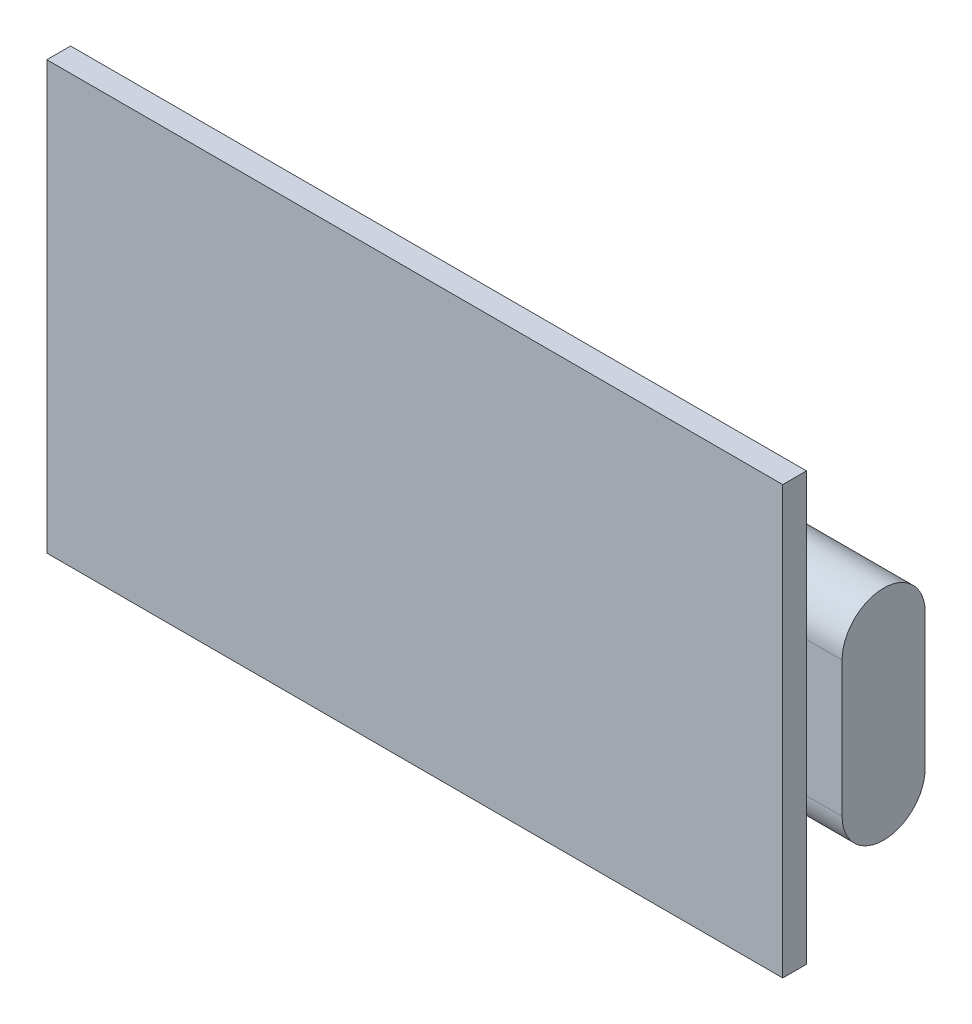
ISO-10303-21;
HEADER;
FILE_DESCRIPTION(('STEP AP214'),'2;1');
FILE_NAME('part.step','',(''),(''),'','','');
FILE_SCHEMA(('AUTOMOTIVE_DESIGN { 1 0 10303 214 1 1 1 1 }'));
ENDSEC;
DATA;
#1=APPLICATION_CONTEXT('core data for automotive mechanical design processes');
#2=APPLICATION_PROTOCOL_DEFINITION('international standard','automotive_design',2000,#1);
#3=PRODUCT_CONTEXT('',#1,'mechanical');
#4=PRODUCT('Part','Part','',(#3));
#5=PRODUCT_RELATED_PRODUCT_CATEGORY('part','',(#4));
#6=PRODUCT_DEFINITION_FORMATION('','',#4);
#7=PRODUCT_DEFINITION_CONTEXT('part definition',#1,'design');
#8=PRODUCT_DEFINITION('design','',#6,#7);
#9=PRODUCT_DEFINITION_SHAPE('','',#8);
#10=(LENGTH_UNIT() NAMED_UNIT(*) SI_UNIT(.MILLI.,.METRE.));
#11=(NAMED_UNIT(*) PLANE_ANGLE_UNIT() SI_UNIT($,.RADIAN.));
#12=(NAMED_UNIT(*) SI_UNIT($,.STERADIAN.) SOLID_ANGLE_UNIT());
#13=UNCERTAINTY_MEASURE_WITH_UNIT(LENGTH_MEASURE(1.E-05),#10,'distance_accuracy_value','');
#14=(GEOMETRIC_REPRESENTATION_CONTEXT(3) GLOBAL_UNCERTAINTY_ASSIGNED_CONTEXT((#13)) GLOBAL_UNIT_ASSIGNED_CONTEXT((#10,
#11,#12)) REPRESENTATION_CONTEXT('',''));
#15=CARTESIAN_POINT('',(0.,0.,0.));
#16=DIRECTION('',(0.,0.,1.));
#17=DIRECTION('',(1.,0.,0.));
#18=AXIS2_PLACEMENT_3D('',#15,#16,#17);
#19=CARTESIAN_POINT('',(0.,0.,0.));
#20=DIRECTION('',(0.,0.,1.));
#21=DIRECTION('',(1.,0.,0.));
#22=AXIS2_PLACEMENT_3D('',#19,#20,#21);
#23=PLANE('',#22);
#24=DIRECTION('',(1.,0.,0.));
#25=VECTOR('',#24,1.);
#26=CARTESIAN_POINT('',(9.50000000000001,2.85,0.));
#27=LINE('',#26,#25);
#28=CARTESIAN_POINT('',(9.50000000000001,2.85,0.));
#29=VERTEX_POINT('',#28);
#30=CARTESIAN_POINT('',(15.5,2.85,0.));
#31=VERTEX_POINT('',#30);
#32=EDGE_CURVE('E110',#29,#31,#27,.T.);
#33=ORIENTED_EDGE('',*,*,#32,.F.);
#34=DIRECTION('',(0.,-1.,0.));
#35=VECTOR('',#34,1.);
#36=CARTESIAN_POINT('',(9.50000000000001,2.85,0.));
#37=LINE('',#36,#35);
#38=CARTESIAN_POINT('',(9.50000000000001,-2.85,0.));
#39=VERTEX_POINT('',#38);
#40=EDGE_CURVE('E48',#29,#39,#37,.T.);
#41=ORIENTED_EDGE('',*,*,#40,.T.);
#42=DIRECTION('',(1.,0.,0.));
#43=VECTOR('',#42,1.);
#44=CARTESIAN_POINT('',(9.50000000000001,-2.85,0.));
#45=LINE('',#44,#43);
#46=CARTESIAN_POINT('',(15.5,-2.85,0.));
#47=VERTEX_POINT('',#46);
#48=EDGE_CURVE('E145',#39,#47,#45,.T.);
#49=ORIENTED_EDGE('',*,*,#48,.T.);
#50=DIRECTION('',(0.,1.,0.));
#51=VECTOR('',#50,1.);
#52=CARTESIAN_POINT('',(15.5,9.,0.));
#53=LINE('',#52,#51);
#54=CARTESIAN_POINT('',(15.5,-9.,0.));
#55=VERTEX_POINT('',#54);
#56=EDGE_CURVE('E158',#55,#47,#53,.T.);
#57=ORIENTED_EDGE('',*,*,#56,.F.);
#58=DIRECTION('',(1.,0.,0.));
#59=VECTOR('',#58,1.);
#60=CARTESIAN_POINT('',(-15.5,-9.,0.));
#61=LINE('',#60,#59);
#62=CARTESIAN_POINT('',(-15.5,-9.,0.));
#63=VERTEX_POINT('',#62);
#64=EDGE_CURVE('E151',#63,#55,#61,.T.);
#65=ORIENTED_EDGE('',*,*,#64,.F.);
#66=DIRECTION('',(0.,-1.,0.));
#67=VECTOR('',#66,1.);
#68=CARTESIAN_POINT('',(-15.5,9.,0.));
#69=LINE('',#68,#67);
#70=CARTESIAN_POINT('',(-15.5,9.,0.));
#71=VERTEX_POINT('',#70);
#72=EDGE_CURVE('E164',#71,#63,#69,.T.);
#73=ORIENTED_EDGE('',*,*,#72,.F.);
#74=DIRECTION('',(-1.,0.,0.));
#75=VECTOR('',#74,1.);
#76=CARTESIAN_POINT('',(-15.5,9.,0.));
#77=LINE('',#76,#75);
#78=CARTESIAN_POINT('',(15.5,9.,0.));
#79=VERTEX_POINT('',#78);
#80=EDGE_CURVE('E161',#79,#71,#77,.T.);
#81=ORIENTED_EDGE('',*,*,#80,.F.);
#82=EDGE_CURVE('E54',#31,#79,#53,.T.);
#83=ORIENTED_EDGE('',*,*,#82,.F.);
#84=EDGE_LOOP('',(#33,#41,#49,#57,#65,#73,#81,#83));
#85=FACE_BOUND('',#84,.T.);
#86=ADVANCED_FACE('F33',(#85),#23,.F.);
#87=CARTESIAN_POINT('',(15.5,9.,1.));
#88=DIRECTION('',(-1.,0.,0.));
#89=DIRECTION('',(0.,-1.,0.));
#90=AXIS2_PLACEMENT_3D('',#87,#88,#89);
#91=PLANE('',#90);
#92=ORIENTED_EDGE('',*,*,#56,.T.);
#93=EDGE_CURVE('E162',#47,#31,#53,.T.);
#94=ORIENTED_EDGE('',*,*,#93,.T.);
#95=ORIENTED_EDGE('',*,*,#82,.T.);
#96=DIRECTION('',(0.,0.,-1.));
#97=VECTOR('',#96,1.);
#98=CARTESIAN_POINT('',(15.5,9.,1.));
#99=LINE('',#98,#97);
#100=CARTESIAN_POINT('',(15.5,9.,1.));
#101=VERTEX_POINT('',#100);
#102=EDGE_CURVE('E11',#101,#79,#99,.T.);
#103=ORIENTED_EDGE('',*,*,#102,.F.);
#104=DIRECTION('',(0.,1.,0.));
#105=VECTOR('',#104,1.);
#106=CARTESIAN_POINT('',(15.5,9.,1.));
#107=LINE('',#106,#105);
#108=CARTESIAN_POINT('',(15.5,-9.,1.));
#109=VERTEX_POINT('',#108);
#110=EDGE_CURVE('E147',#109,#101,#107,.T.);
#111=ORIENTED_EDGE('',*,*,#110,.F.);
#112=DIRECTION('',(0.,0.,-1.));
#113=VECTOR('',#112,1.);
#114=CARTESIAN_POINT('',(15.5,-9.,1.));
#115=LINE('',#114,#113);
#116=EDGE_CURVE('E157',#109,#55,#115,.T.);
#117=ORIENTED_EDGE('',*,*,#116,.T.);
#118=EDGE_LOOP('',(#92,#94,#95,#103,#111,#117));
#119=FACE_BOUND('',#118,.T.);
#120=ADVANCED_FACE('F35',(#119),#91,.F.);
#121=CARTESIAN_POINT('',(-15.5,9.,1.));
#122=DIRECTION('',(0.,-1.,0.));
#123=DIRECTION('',(0.,0.,-1.));
#124=AXIS2_PLACEMENT_3D('',#121,#122,#123);
#125=PLANE('',#124);
#126=ORIENTED_EDGE('',*,*,#80,.T.);
#127=DIRECTION('',(0.,0.,-1.));
#128=VECTOR('',#127,1.);
#129=CARTESIAN_POINT('',(-15.5,9.,1.));
#130=LINE('',#129,#128);
#131=CARTESIAN_POINT('',(-15.5,9.,1.));
#132=VERTEX_POINT('',#131);
#133=EDGE_CURVE('E41',#132,#71,#130,.T.);
#134=ORIENTED_EDGE('',*,*,#133,.F.);
#135=DIRECTION('',(-1.,0.,0.));
#136=VECTOR('',#135,1.);
#137=CARTESIAN_POINT('',(-15.5,9.,1.));
#138=LINE('',#137,#136);
#139=EDGE_CURVE('E150',#101,#132,#138,.T.);
#140=ORIENTED_EDGE('',*,*,#139,.F.);
#141=ORIENTED_EDGE('',*,*,#102,.T.);
#142=EDGE_LOOP('',(#126,#134,#140,#141));
#143=FACE_BOUND('',#142,.T.);
#144=ADVANCED_FACE('F190',(#143),#125,.F.);
#145=CARTESIAN_POINT('',(-15.5,9.,1.));
#146=DIRECTION('',(1.,0.,0.));
#147=DIRECTION('',(0.,0.,-1.));
#148=AXIS2_PLACEMENT_3D('',#145,#146,#147);
#149=PLANE('',#148);
#150=ORIENTED_EDGE('',*,*,#72,.T.);
#151=DIRECTION('',(0.,0.,-1.));
#152=VECTOR('',#151,1.);
#153=CARTESIAN_POINT('',(-15.5,-9.,1.));
#154=LINE('',#153,#152);
#155=CARTESIAN_POINT('',(-15.5,-9.,1.));
#156=VERTEX_POINT('',#155);
#157=EDGE_CURVE('E169',#156,#63,#154,.T.);
#158=ORIENTED_EDGE('',*,*,#157,.F.);
#159=DIRECTION('',(0.,-1.,0.));
#160=VECTOR('',#159,1.);
#161=CARTESIAN_POINT('',(-15.5,9.,1.));
#162=LINE('',#161,#160);
#163=EDGE_CURVE('E153',#132,#156,#162,.T.);
#164=ORIENTED_EDGE('',*,*,#163,.F.);
#165=ORIENTED_EDGE('',*,*,#133,.T.);
#166=EDGE_LOOP('',(#150,#158,#164,#165));
#167=FACE_BOUND('',#166,.T.);
#168=ADVANCED_FACE('F176',(#167),#149,.F.);
#169=CARTESIAN_POINT('',(-15.5,-9.,1.));
#170=DIRECTION('',(0.,1.,0.));
#171=DIRECTION('',(0.,0.,1.));
#172=AXIS2_PLACEMENT_3D('',#169,#170,#171);
#173=PLANE('',#172);
#174=ORIENTED_EDGE('',*,*,#64,.T.);
#175=ORIENTED_EDGE('',*,*,#116,.F.);
#176=DIRECTION('',(1.,0.,0.));
#177=VECTOR('',#176,1.);
#178=CARTESIAN_POINT('',(-15.5,-9.,1.));
#179=LINE('',#178,#177);
#180=EDGE_CURVE('E155',#156,#109,#179,.T.);
#181=ORIENTED_EDGE('',*,*,#180,.F.);
#182=ORIENTED_EDGE('',*,*,#157,.T.);
#183=EDGE_LOOP('',(#174,#175,#181,#182));
#184=FACE_BOUND('',#183,.T.);
#185=ADVANCED_FACE('F183',(#184),#173,.F.);
#186=CARTESIAN_POINT('',(0.,0.,1.));
#187=DIRECTION('',(0.,0.,1.));
#188=DIRECTION('',(1.,0.,0.));
#189=AXIS2_PLACEMENT_3D('',#186,#187,#188);
#190=PLANE('',#189);
#191=ORIENTED_EDGE('',*,*,#110,.T.);
#192=ORIENTED_EDGE('',*,*,#139,.T.);
#193=ORIENTED_EDGE('',*,*,#163,.T.);
#194=ORIENTED_EDGE('',*,*,#180,.T.);
#195=EDGE_LOOP('',(#191,#192,#193,#194));
#196=FACE_BOUND('',#195,.T.);
#197=ADVANCED_FACE('F189',(#196),#190,.T.);
#198=CARTESIAN_POINT('',(9.50000000000001,2.85,0.));
#199=DIRECTION('',(0.,0.,1.));
#200=DIRECTION('',(1.,0.,0.));
#201=AXIS2_PLACEMENT_3D('',#198,#199,#200);
#202=PLANE('',#201);
#203=ORIENTED_EDGE('',*,*,#93,.F.);
#204=CARTESIAN_POINT('',(17.,-2.85,0.));
#205=VERTEX_POINT('',#204);
#206=EDGE_CURVE('E119',#47,#205,#45,.T.);
#207=ORIENTED_EDGE('',*,*,#206,.T.);
#208=DIRECTION('',(0.,-1.,0.));
#209=VECTOR('',#208,1.);
#210=CARTESIAN_POINT('',(17.,2.85,0.));
#211=LINE('',#210,#209);
#212=CARTESIAN_POINT('',(17.,2.85,0.));
#213=VERTEX_POINT('',#212);
#214=EDGE_CURVE('E116',#213,#205,#211,.T.);
#215=ORIENTED_EDGE('',*,*,#214,.F.);
#216=EDGE_CURVE('E104',#31,#213,#27,.T.);
#217=ORIENTED_EDGE('',*,*,#216,.F.);
#218=EDGE_LOOP('',(#203,#207,#215,#217));
#219=FACE_BOUND('',#218,.T.);
#220=ADVANCED_FACE('F117',(#219),#202,.T.);
#221=CARTESIAN_POINT('',(9.50000000000001,2.85,-1.75));
#222=DIRECTION('',(1.,0.,0.));
#223=DIRECTION('',(0.,1.,0.));
#224=AXIS2_PLACEMENT_3D('',#221,#222,#223);
#225=CYLINDRICAL_SURFACE('',#224,1.75);
#226=ORIENTED_EDGE('',*,*,#32,.T.);
#227=ORIENTED_EDGE('',*,*,#216,.T.);
#228=CARTESIAN_POINT('',(17.,2.85,-1.75));
#229=DIRECTION('',(1.,0.,0.));
#230=DIRECTION('',(0.,1.,0.));
#231=AXIS2_PLACEMENT_3D('',#228,#229,#230);
#232=CIRCLE('',#231,1.75);
#233=CARTESIAN_POINT('',(17.,2.85,-3.5));
#234=VERTEX_POINT('',#233);
#235=EDGE_CURVE('E108',#234,#213,#232,.T.);
#236=ORIENTED_EDGE('',*,*,#235,.F.);
#237=DIRECTION('',(1.,0.,0.));
#238=VECTOR('',#237,1.);
#239=CARTESIAN_POINT('',(9.50000000000001,2.85,-3.5));
#240=LINE('',#239,#238);
#241=CARTESIAN_POINT('',(9.50000000000001,2.85,-3.5));
#242=VERTEX_POINT('',#241);
#243=EDGE_CURVE('E141',#242,#234,#240,.T.);
#244=ORIENTED_EDGE('',*,*,#243,.F.);
#245=CARTESIAN_POINT('',(9.50000000000001,2.85,-1.75));
#246=DIRECTION('',(1.,0.,0.));
#247=DIRECTION('',(0.,1.,0.));
#248=AXIS2_PLACEMENT_3D('',#245,#246,#247);
#249=CIRCLE('',#248,1.75);
#250=EDGE_CURVE('E133',#242,#29,#249,.T.);
#251=ORIENTED_EDGE('',*,*,#250,.T.);
#252=EDGE_LOOP('',(#226,#227,#236,#244,#251));
#253=FACE_BOUND('',#252,.T.);
#254=ADVANCED_FACE('F106',(#253),#225,.T.);
#255=CARTESIAN_POINT('',(9.50000000000001,2.85,-3.5));
#256=DIRECTION('',(0.,0.,-1.));
#257=DIRECTION('',(-1.,0.,0.));
#258=AXIS2_PLACEMENT_3D('',#255,#256,#257);
#259=PLANE('',#258);
#260=ORIENTED_EDGE('',*,*,#243,.T.);
#261=DIRECTION('',(0.,1.,0.));
#262=VECTOR('',#261,1.);
#263=CARTESIAN_POINT('',(17.,2.85,-3.5));
#264=LINE('',#263,#262);
#265=CARTESIAN_POINT('',(17.,-2.85,-3.5));
#266=VERTEX_POINT('',#265);
#267=EDGE_CURVE('E128',#266,#234,#264,.T.);
#268=ORIENTED_EDGE('',*,*,#267,.F.);
#269=DIRECTION('',(1.,0.,0.));
#270=VECTOR('',#269,1.);
#271=CARTESIAN_POINT('',(9.50000000000001,-2.85,-3.5));
#272=LINE('',#271,#270);
#273=CARTESIAN_POINT('',(9.50000000000001,-2.85,-3.5));
#274=VERTEX_POINT('',#273);
#275=EDGE_CURVE('E143',#274,#266,#272,.T.);
#276=ORIENTED_EDGE('',*,*,#275,.F.);
#277=DIRECTION('',(0.,1.,0.));
#278=VECTOR('',#277,1.);
#279=CARTESIAN_POINT('',(9.50000000000001,2.85,-3.5));
#280=LINE('',#279,#278);
#281=EDGE_CURVE('E113',#274,#242,#280,.T.);
#282=ORIENTED_EDGE('',*,*,#281,.T.);
#283=EDGE_LOOP('',(#260,#268,#276,#282));
#284=FACE_BOUND('',#283,.T.);
#285=ADVANCED_FACE('F215',(#284),#259,.T.);
#286=CARTESIAN_POINT('',(9.50000000000001,-2.85,-1.75));
#287=DIRECTION('',(1.,0.,0.));
#288=DIRECTION('',(0.,1.,0.));
#289=AXIS2_PLACEMENT_3D('',#286,#287,#288);
#290=CYLINDRICAL_SURFACE('',#289,1.75);
#291=ORIENTED_EDGE('',*,*,#275,.T.);
#292=CARTESIAN_POINT('',(17.,-2.85,-1.75));
#293=DIRECTION('',(1.,0.,0.));
#294=DIRECTION('',(0.,1.,0.));
#295=AXIS2_PLACEMENT_3D('',#292,#293,#294);
#296=CIRCLE('',#295,1.75);
#297=EDGE_CURVE('E123',#205,#266,#296,.T.);
#298=ORIENTED_EDGE('',*,*,#297,.F.);
#299=ORIENTED_EDGE('',*,*,#206,.F.);
#300=ORIENTED_EDGE('',*,*,#48,.F.);
#301=CARTESIAN_POINT('',(9.50000000000001,-2.85,-1.75));
#302=DIRECTION('',(1.,0.,0.));
#303=DIRECTION('',(0.,1.,0.));
#304=AXIS2_PLACEMENT_3D('',#301,#302,#303);
#305=CIRCLE('',#304,1.75);
#306=EDGE_CURVE('E136',#39,#274,#305,.T.);
#307=ORIENTED_EDGE('',*,*,#306,.T.);
#308=EDGE_LOOP('',(#291,#298,#299,#300,#307));
#309=FACE_BOUND('',#308,.T.);
#310=ADVANCED_FACE('F217',(#309),#290,.T.);
#311=CARTESIAN_POINT('',(9.50000000000001,2.85,-1.75));
#312=DIRECTION('',(1.,0.,0.));
#313=DIRECTION('',(0.,1.,0.));
#314=AXIS2_PLACEMENT_3D('',#311,#312,#313);
#315=PLANE('',#314);
#316=ORIENTED_EDGE('',*,*,#250,.F.);
#317=ORIENTED_EDGE('',*,*,#281,.F.);
#318=ORIENTED_EDGE('',*,*,#306,.F.);
#319=ORIENTED_EDGE('',*,*,#40,.F.);
#320=EDGE_LOOP('',(#316,#317,#318,#319));
#321=FACE_BOUND('',#320,.T.);
#322=ADVANCED_FACE('F220',(#321),#315,.F.);
#323=CARTESIAN_POINT('',(17.,2.85,-1.75));
#324=DIRECTION('',(1.,0.,0.));
#325=DIRECTION('',(0.,1.,0.));
#326=AXIS2_PLACEMENT_3D('',#323,#324,#325);
#327=PLANE('',#326);
#328=ORIENTED_EDGE('',*,*,#235,.T.);
#329=ORIENTED_EDGE('',*,*,#214,.T.);
#330=ORIENTED_EDGE('',*,*,#297,.T.);
#331=ORIENTED_EDGE('',*,*,#267,.T.);
#332=EDGE_LOOP('',(#328,#329,#330,#331));
#333=FACE_BOUND('',#332,.T.);
#334=ADVANCED_FACE('F126',(#333),#327,.T.);
#335=CLOSED_SHELL('',(#86,#120,#144,#168,#185,#197,#220,#254,#285,#310,#322,#334));
#336=MANIFOLD_SOLID_BREP('B2',#335);
#337=ADVANCED_BREP_SHAPE_REPRESENTATION('',(#18,#336),#14);
#338=SHAPE_DEFINITION_REPRESENTATION(#9,#337);
ENDSEC;
END-ISO-10303-21;
